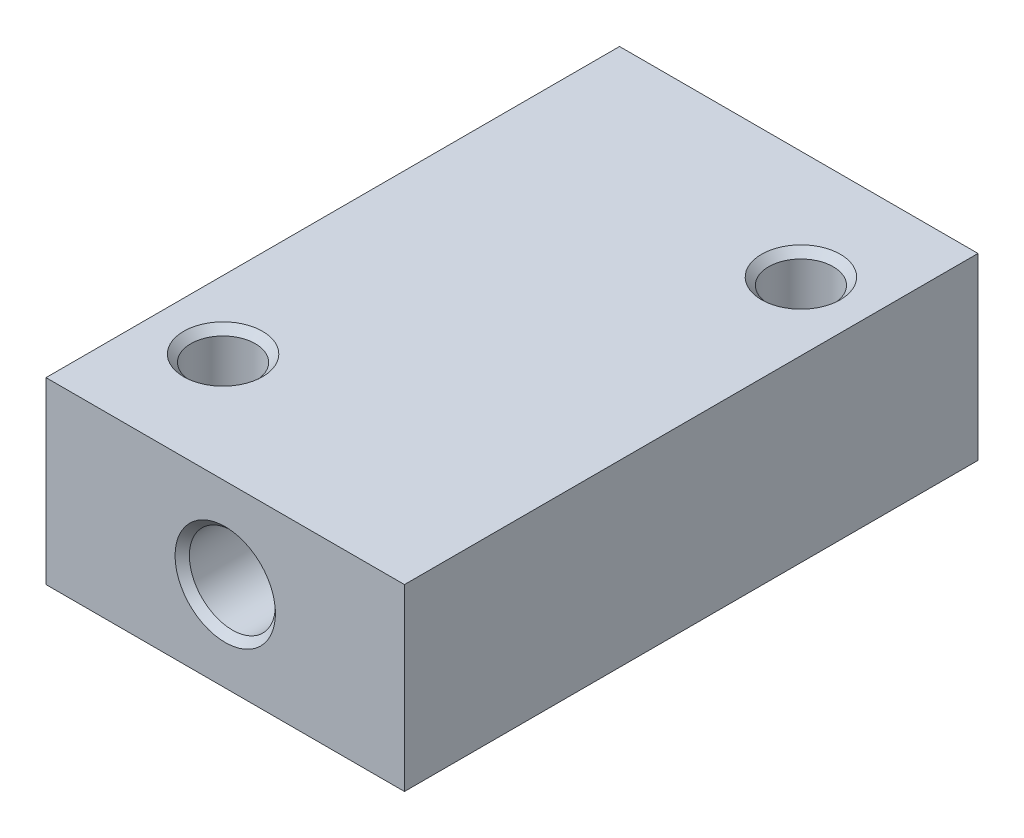
ISO-10303-21;
HEADER;
FILE_DESCRIPTION(('STEP AP214'),'2;1');
FILE_NAME('part.step','',(''),(''),'','','');
FILE_SCHEMA(('AUTOMOTIVE_DESIGN { 1 0 10303 214 1 1 1 1 }'));
ENDSEC;
DATA;
#1=APPLICATION_CONTEXT('core data for automotive mechanical design processes');
#2=APPLICATION_PROTOCOL_DEFINITION('international standard','automotive_design',2000,#1);
#3=PRODUCT_CONTEXT('',#1,'mechanical');
#4=PRODUCT('Part','Part','',(#3));
#5=PRODUCT_RELATED_PRODUCT_CATEGORY('part','',(#4));
#6=PRODUCT_DEFINITION_FORMATION('','',#4);
#7=PRODUCT_DEFINITION_CONTEXT('part definition',#1,'design');
#8=PRODUCT_DEFINITION('design','',#6,#7);
#9=PRODUCT_DEFINITION_SHAPE('','',#8);
#10=(LENGTH_UNIT() NAMED_UNIT(*) SI_UNIT(.MILLI.,.METRE.));
#11=(NAMED_UNIT(*) PLANE_ANGLE_UNIT() SI_UNIT($,.RADIAN.));
#12=(NAMED_UNIT(*) SI_UNIT($,.STERADIAN.) SOLID_ANGLE_UNIT());
#13=UNCERTAINTY_MEASURE_WITH_UNIT(LENGTH_MEASURE(1.E-05),#10,'distance_accuracy_value','');
#14=(GEOMETRIC_REPRESENTATION_CONTEXT(3) GLOBAL_UNCERTAINTY_ASSIGNED_CONTEXT((#13)) GLOBAL_UNIT_ASSIGNED_CONTEXT((#10,
#11,#12)) REPRESENTATION_CONTEXT('',''));
#15=CARTESIAN_POINT('',(0.,0.,0.));
#16=DIRECTION('',(0.,0.,1.));
#17=DIRECTION('',(1.,0.,0.));
#18=AXIS2_PLACEMENT_3D('',#15,#16,#17);
#19=CARTESIAN_POINT('',(0.,25.,0.));
#20=DIRECTION('',(0.,1.,0.));
#21=DIRECTION('',(0.,0.,1.));
#22=AXIS2_PLACEMENT_3D('',#19,#20,#21);
#23=PLANE('',#22);
#24=CARTESIAN_POINT('',(15.5000000000003,25.,-24.8000000000015));
#25=DIRECTION('',(0.,1.,0.));
#26=DIRECTION('',(0.,0.,1.));
#27=AXIS2_PLACEMENT_3D('',#24,#25,#26);
#28=CIRCLE('',#27,5.50000000000001);
#29=CARTESIAN_POINT('',(15.5000000000003,25.,-19.3000000000015));
#30=VERTEX_POINT('',#29);
#31=EDGE_CURVE('E11',#30,#30,#28,.F.);
#32=ORIENTED_EDGE('',*,*,#31,.T.);
#33=EDGE_LOOP('',(#32));
#34=FACE_BOUND('',#33,.T.);
#35=CARTESIAN_POINT('',(-15.5000000000013,25.,24.8000000000053));
#36=DIRECTION('',(0.,1.,0.));
#37=DIRECTION('',(0.,0.,1.));
#38=AXIS2_PLACEMENT_3D('',#35,#36,#37);
#39=CIRCLE('',#38,5.50000000000001);
#40=CARTESIAN_POINT('',(-15.5000000000013,25.,30.3000000000053));
#41=VERTEX_POINT('',#40);
#42=EDGE_CURVE('E45',#41,#41,#39,.F.);
#43=ORIENTED_EDGE('',*,*,#42,.T.);
#44=EDGE_LOOP('',(#43));
#45=FACE_BOUND('',#44,.T.);
#46=DIRECTION('',(0.,0.,-1.));
#47=VECTOR('',#46,1.);
#48=CARTESIAN_POINT('',(25.0000000000004,25.,-40.0000000000008));
#49=LINE('',#48,#47);
#50=CARTESIAN_POINT('',(25.0000000000024,25.,40.0000000000058));
#51=VERTEX_POINT('',#50);
#52=CARTESIAN_POINT('',(25.0000000000004,25.,-40.0000000000008));
#53=VERTEX_POINT('',#52);
#54=EDGE_CURVE('E88',#51,#53,#49,.T.);
#55=ORIENTED_EDGE('',*,*,#54,.T.);
#56=DIRECTION('',(-1.,0.,0.));
#57=VECTOR('',#56,1.);
#58=CARTESIAN_POINT('',(-25.0000000000014,25.,-40.0000000000026));
#59=LINE('',#58,#57);
#60=CARTESIAN_POINT('',(-25.0000000000014,25.,-40.0000000000026));
#61=VERTEX_POINT('',#60);
#62=EDGE_CURVE('E84',#53,#61,#59,.T.);
#63=ORIENTED_EDGE('',*,*,#62,.T.);
#64=DIRECTION('',(0.,0.,1.));
#65=VECTOR('',#64,1.);
#66=CARTESIAN_POINT('',(-25.0000000000014,25.,-40.0000000000026));
#67=LINE('',#66,#65);
#68=CARTESIAN_POINT('',(-25.0000000000037,25.,40.0000000000068));
#69=VERTEX_POINT('',#68);
#70=EDGE_CURVE('E86',#61,#69,#67,.T.);
#71=ORIENTED_EDGE('',*,*,#70,.T.);
#72=DIRECTION('',(1.,0.,0.));
#73=VECTOR('',#72,1.);
#74=CARTESIAN_POINT('',(-25.0000000000037,25.,40.0000000000068));
#75=LINE('',#74,#73);
#76=EDGE_CURVE('E53',#69,#51,#75,.T.);
#77=ORIENTED_EDGE('',*,*,#76,.T.);
#78=EDGE_LOOP('',(#55,#63,#71,#77));
#79=FACE_BOUND('',#78,.T.);
#80=ADVANCED_FACE('F36',(#34,#45,#79),#23,.T.);
#81=CARTESIAN_POINT('',(0.,0.,0.));
#82=DIRECTION('',(0.,1.,0.));
#83=DIRECTION('',(0.,0.,1.));
#84=AXIS2_PLACEMENT_3D('',#81,#82,#83);
#85=PLANE('',#84);
#86=CARTESIAN_POINT('',(15.5000000000003,0.,-24.8000000000015));
#87=DIRECTION('',(0.,1.,0.));
#88=DIRECTION('',(0.,0.,1.));
#89=AXIS2_PLACEMENT_3D('',#86,#87,#88);
#90=CIRCLE('',#89,5.50000000000002);
#91=CARTESIAN_POINT('',(15.5000000000003,0.,-19.3000000000015));
#92=VERTEX_POINT('',#91);
#93=EDGE_CURVE('E127',#92,#92,#90,.T.);
#94=ORIENTED_EDGE('',*,*,#93,.T.);
#95=EDGE_LOOP('',(#94));
#96=FACE_BOUND('',#95,.T.);
#97=CARTESIAN_POINT('',(-15.5000000000013,0.,24.8000000000053));
#98=DIRECTION('',(0.,1.,0.));
#99=DIRECTION('',(0.,0.,1.));
#100=AXIS2_PLACEMENT_3D('',#97,#98,#99);
#101=CIRCLE('',#100,5.50000000000002);
#102=CARTESIAN_POINT('',(-15.5000000000013,0.,30.3000000000053));
#103=VERTEX_POINT('',#102);
#104=EDGE_CURVE('E124',#103,#103,#101,.T.);
#105=ORIENTED_EDGE('',*,*,#104,.T.);
#106=EDGE_LOOP('',(#105));
#107=FACE_BOUND('',#106,.T.);
#108=DIRECTION('',(0.,0.,-1.));
#109=VECTOR('',#108,1.);
#110=CARTESIAN_POINT('',(25.0000000000004,0.,-40.0000000000008));
#111=LINE('',#110,#109);
#112=CARTESIAN_POINT('',(25.0000000000024,0.,40.0000000000058));
#113=VERTEX_POINT('',#112);
#114=CARTESIAN_POINT('',(25.0000000000004,0.,-40.0000000000008));
#115=VERTEX_POINT('',#114);
#116=EDGE_CURVE('E103',#113,#115,#111,.T.);
#117=ORIENTED_EDGE('',*,*,#116,.F.);
#118=DIRECTION('',(1.,0.,0.));
#119=VECTOR('',#118,1.);
#120=CARTESIAN_POINT('',(-25.0000000000037,0.,40.0000000000068));
#121=LINE('',#120,#119);
#122=CARTESIAN_POINT('',(-25.0000000000037,0.,40.0000000000068));
#123=VERTEX_POINT('',#122);
#124=EDGE_CURVE('E76',#123,#113,#121,.T.);
#125=ORIENTED_EDGE('',*,*,#124,.F.);
#126=DIRECTION('',(0.,0.,1.));
#127=VECTOR('',#126,1.);
#128=CARTESIAN_POINT('',(-25.0000000000014,0.,-40.0000000000026));
#129=LINE('',#128,#127);
#130=CARTESIAN_POINT('',(-25.0000000000014,0.,-40.0000000000026));
#131=VERTEX_POINT('',#130);
#132=EDGE_CURVE('E70',#131,#123,#129,.T.);
#133=ORIENTED_EDGE('',*,*,#132,.F.);
#134=DIRECTION('',(-1.,0.,0.));
#135=VECTOR('',#134,1.);
#136=CARTESIAN_POINT('',(-25.0000000000014,0.,-40.0000000000026));
#137=LINE('',#136,#135);
#138=EDGE_CURVE('E93',#115,#131,#137,.T.);
#139=ORIENTED_EDGE('',*,*,#138,.F.);
#140=EDGE_LOOP('',(#117,#125,#133,#139));
#141=FACE_BOUND('',#140,.T.);
#142=ADVANCED_FACE('F167',(#96,#107,#141),#85,.F.);
#143=CARTESIAN_POINT('',(25.0000000000004,25.,-40.0000000000008));
#144=DIRECTION('',(-1.,0.,0.));
#145=DIRECTION('',(0.,0.,1.));
#146=AXIS2_PLACEMENT_3D('',#143,#144,#145);
#147=PLANE('',#146);
#148=ORIENTED_EDGE('',*,*,#116,.T.);
#149=DIRECTION('',(0.,-1.,0.));
#150=VECTOR('',#149,1.);
#151=CARTESIAN_POINT('',(25.0000000000004,25.,-40.0000000000008));
#152=LINE('',#151,#150);
#153=EDGE_CURVE('E94',#53,#115,#152,.T.);
#154=ORIENTED_EDGE('',*,*,#153,.F.);
#155=ORIENTED_EDGE('',*,*,#54,.F.);
#156=DIRECTION('',(0.,-1.,0.));
#157=VECTOR('',#156,1.);
#158=CARTESIAN_POINT('',(25.0000000000024,25.,40.0000000000058));
#159=LINE('',#158,#157);
#160=EDGE_CURVE('E99',#51,#113,#159,.T.);
#161=ORIENTED_EDGE('',*,*,#160,.T.);
#162=EDGE_LOOP('',(#148,#154,#155,#161));
#163=FACE_BOUND('',#162,.T.);
#164=ADVANCED_FACE('F173',(#163),#147,.F.);
#165=CARTESIAN_POINT('',(-25.0000000000014,25.,-40.0000000000026));
#166=DIRECTION('',(0.,0.,1.));
#167=DIRECTION('',(1.,0.,0.));
#168=AXIS2_PLACEMENT_3D('',#165,#166,#167);
#169=PLANE('',#168);
#170=CARTESIAN_POINT('',(-7.21644966006352E-13,12.5000000000001,-40.0000000000029));
#171=DIRECTION('',(0.,0.,1.));
#172=DIRECTION('',(1.,0.,0.));
#173=AXIS2_PLACEMENT_3D('',#170,#171,#172);
#174=CIRCLE('',#173,7.00000000000002);
#175=CARTESIAN_POINT('',(6.99999999999931,12.5000000000001,-40.0000000000029));
#176=VERTEX_POINT('',#175);
#177=EDGE_CURVE('E112',#176,#176,#174,.T.);
#178=ORIENTED_EDGE('',*,*,#177,.T.);
#179=EDGE_LOOP('',(#178));
#180=FACE_BOUND('',#179,.T.);
#181=ORIENTED_EDGE('',*,*,#138,.T.);
#182=DIRECTION('',(0.,-1.,0.));
#183=VECTOR('',#182,1.);
#184=CARTESIAN_POINT('',(-25.0000000000014,25.,-40.0000000000026));
#185=LINE('',#184,#183);
#186=EDGE_CURVE('E91',#61,#131,#185,.T.);
#187=ORIENTED_EDGE('',*,*,#186,.F.);
#188=ORIENTED_EDGE('',*,*,#62,.F.);
#189=ORIENTED_EDGE('',*,*,#153,.T.);
#190=EDGE_LOOP('',(#181,#187,#188,#189));
#191=FACE_BOUND('',#190,.T.);
#192=ADVANCED_FACE('F92',(#180,#191),#169,.F.);
#193=CARTESIAN_POINT('',(-25.0000000000014,25.,-40.0000000000026));
#194=DIRECTION('',(1.,0.,0.));
#195=DIRECTION('',(0.,0.,-1.));
#196=AXIS2_PLACEMENT_3D('',#193,#194,#195);
#197=PLANE('',#196);
#198=ORIENTED_EDGE('',*,*,#132,.T.);
#199=DIRECTION('',(0.,-1.,0.));
#200=VECTOR('',#199,1.);
#201=CARTESIAN_POINT('',(-25.0000000000037,25.,40.0000000000068));
#202=LINE('',#201,#200);
#203=EDGE_CURVE('E95',#69,#123,#202,.T.);
#204=ORIENTED_EDGE('',*,*,#203,.F.);
#205=ORIENTED_EDGE('',*,*,#70,.F.);
#206=ORIENTED_EDGE('',*,*,#186,.T.);
#207=EDGE_LOOP('',(#198,#204,#205,#206));
#208=FACE_BOUND('',#207,.T.);
#209=ADVANCED_FACE('F97',(#208),#197,.F.);
#210=CARTESIAN_POINT('',(-25.0000000000037,25.,40.0000000000068));
#211=DIRECTION('',(0.,0.,-1.));
#212=DIRECTION('',(-1.,0.,0.));
#213=AXIS2_PLACEMENT_3D('',#210,#211,#212);
#214=PLANE('',#213);
#215=CARTESIAN_POINT('',(-9.43689570931383E-13,12.5000000000001,40.0000000000055));
#216=DIRECTION('',(0.,0.,-1.));
#217=DIRECTION('',(-1.,0.,0.));
#218=AXIS2_PLACEMENT_3D('',#215,#216,#217);
#219=CIRCLE('',#218,7.00000000000002);
#220=CARTESIAN_POINT('',(-7.00000000000097,12.5000000000001,40.0000000000055));
#221=VERTEX_POINT('',#220);
#222=EDGE_CURVE('E121',#221,#221,#219,.T.);
#223=ORIENTED_EDGE('',*,*,#222,.T.);
#224=EDGE_LOOP('',(#223));
#225=FACE_BOUND('',#224,.T.);
#226=ORIENTED_EDGE('',*,*,#124,.T.);
#227=ORIENTED_EDGE('',*,*,#160,.F.);
#228=ORIENTED_EDGE('',*,*,#76,.F.);
#229=ORIENTED_EDGE('',*,*,#203,.T.);
#230=EDGE_LOOP('',(#226,#227,#228,#229));
#231=FACE_BOUND('',#230,.T.);
#232=ADVANCED_FACE('F163',(#225,#231),#214,.F.);
#233=CARTESIAN_POINT('',(15.5000000000003,25.,-24.8000000000015));
#234=DIRECTION('',(0.,-1.,0.));
#235=DIRECTION('',(0.,0.,-1.));
#236=AXIS2_PLACEMENT_3D('',#233,#234,#235);
#237=CYLINDRICAL_SURFACE('',#236,4.5);
#238=CARTESIAN_POINT('',(15.5000000000003,0.99999999999989,-24.8000000000015));
#239=DIRECTION('',(0.,1.,0.));
#240=DIRECTION('',(0.,0.,1.));
#241=AXIS2_PLACEMENT_3D('',#238,#239,#240);
#242=CIRCLE('',#241,4.5);
#243=CARTESIAN_POINT('',(15.5000000000003,0.99999999999989,-20.3000000000015));
#244=VERTEX_POINT('',#243);
#245=EDGE_CURVE('E133',#244,#244,#242,.F.);
#246=ORIENTED_EDGE('',*,*,#245,.T.);
#247=EDGE_LOOP('',(#246));
#248=FACE_BOUND('',#247,.T.);
#249=CARTESIAN_POINT('',(15.5000000000003,24.,-24.8000000000015));
#250=DIRECTION('',(0.,1.,0.));
#251=DIRECTION('',(0.,0.,1.));
#252=AXIS2_PLACEMENT_3D('',#249,#250,#251);
#253=CIRCLE('',#252,4.5);
#254=CARTESIAN_POINT('',(15.5000000000003,24.,-20.3000000000015));
#255=VERTEX_POINT('',#254);
#256=EDGE_CURVE('E130',#255,#255,#253,.T.);
#257=ORIENTED_EDGE('',*,*,#256,.T.);
#258=EDGE_LOOP('',(#257));
#259=FACE_BOUND('',#258,.T.);
#260=ADVANCED_FACE('F153',(#248,#259),#237,.F.);
#261=CARTESIAN_POINT('',(-15.5000000000013,25.,24.8000000000053));
#262=DIRECTION('',(0.,-1.,0.));
#263=DIRECTION('',(0.,0.,-1.));
#264=AXIS2_PLACEMENT_3D('',#261,#262,#263);
#265=CYLINDRICAL_SURFACE('',#264,4.5);
#266=CARTESIAN_POINT('',(-15.5000000000013,0.99999999999989,24.8000000000053));
#267=DIRECTION('',(0.,1.,0.));
#268=DIRECTION('',(0.,0.,1.));
#269=AXIS2_PLACEMENT_3D('',#266,#267,#268);
#270=CIRCLE('',#269,4.5);
#271=CARTESIAN_POINT('',(-15.5000000000013,0.99999999999989,29.3000000000053));
#272=VERTEX_POINT('',#271);
#273=EDGE_CURVE('E139',#272,#272,#270,.F.);
#274=ORIENTED_EDGE('',*,*,#273,.T.);
#275=EDGE_LOOP('',(#274));
#276=FACE_BOUND('',#275,.T.);
#277=CARTESIAN_POINT('',(-15.5000000000013,24.,24.8000000000053));
#278=DIRECTION('',(0.,1.,0.));
#279=DIRECTION('',(0.,0.,1.));
#280=AXIS2_PLACEMENT_3D('',#277,#278,#279);
#281=CIRCLE('',#280,4.5);
#282=CARTESIAN_POINT('',(-15.5000000000013,24.,29.3000000000053));
#283=VERTEX_POINT('',#282);
#284=EDGE_CURVE('E136',#283,#283,#281,.T.);
#285=ORIENTED_EDGE('',*,*,#284,.T.);
#286=EDGE_LOOP('',(#285));
#287=FACE_BOUND('',#286,.T.);
#288=ADVANCED_FACE('F150',(#276,#287),#265,.F.);
#289=CARTESIAN_POINT('',(-7.21644966006352E-13,12.5000000000001,-40.0000000000029));
#290=DIRECTION('',(0.,0.,1.));
#291=DIRECTION('',(1.,0.,0.));
#292=AXIS2_PLACEMENT_3D('',#289,#290,#291);
#293=CYLINDRICAL_SURFACE('',#292,6.);
#294=CARTESIAN_POINT('',(1.66533453693773E-13,12.5000000000001,-39.0000000000018));
#295=DIRECTION('',(0.,0.,1.));
#296=DIRECTION('',(1.,0.,0.));
#297=AXIS2_PLACEMENT_3D('',#294,#295,#296);
#298=CIRCLE('',#297,6.);
#299=CARTESIAN_POINT('',(6.00000000000017,12.5000000000001,-39.0000000000018));
#300=VERTEX_POINT('',#299);
#301=EDGE_CURVE('E118',#300,#300,#298,.F.);
#302=ORIENTED_EDGE('',*,*,#301,.T.);
#303=EDGE_LOOP('',(#302));
#304=FACE_BOUND('',#303,.T.);
#305=CARTESIAN_POINT('',(-4.9960036108132E-13,12.5000000000001,39.0000000000052));
#306=DIRECTION('',(0.,0.,-1.));
#307=DIRECTION('',(-1.,0.,0.));
#308=AXIS2_PLACEMENT_3D('',#305,#306,#307);
#309=CIRCLE('',#308,6.);
#310=CARTESIAN_POINT('',(-6.00000000000051,12.5000000000001,39.0000000000052));
#311=VERTEX_POINT('',#310);
#312=EDGE_CURVE('E115',#311,#311,#309,.F.);
#313=ORIENTED_EDGE('',*,*,#312,.T.);
#314=EDGE_LOOP('',(#313));
#315=FACE_BOUND('',#314,.T.);
#316=ADVANCED_FACE('F152',(#304,#315),#293,.F.);
#317=CARTESIAN_POINT('',(-7.21644966006352E-13,12.5000000000001,-40.0000000000029));
#318=DIRECTION('',(0.,0.,-1.));
#319=DIRECTION('',(-1.,0.,0.));
#320=AXIS2_PLACEMENT_3D('',#317,#318,#319);
#321=CONICAL_SURFACE('',#320,7.00000000000002,0.78539816339745);
#322=ORIENTED_EDGE('',*,*,#301,.F.);
#323=EDGE_LOOP('',(#322));
#324=FACE_BOUND('',#323,.T.);
#325=ORIENTED_EDGE('',*,*,#177,.F.);
#326=EDGE_LOOP('',(#325));
#327=FACE_BOUND('',#326,.T.);
#328=ADVANCED_FACE('F160',(#324,#327),#321,.F.);
#329=CARTESIAN_POINT('',(-4.9960036108132E-13,12.5000000000001,39.0000000000052));
#330=DIRECTION('',(0.,0.,1.));
#331=DIRECTION('',(1.,0.,0.));
#332=AXIS2_PLACEMENT_3D('',#329,#330,#331);
#333=CONICAL_SURFACE('',#332,6.,0.785398163397458);
#334=ORIENTED_EDGE('',*,*,#222,.F.);
#335=EDGE_LOOP('',(#334));
#336=FACE_BOUND('',#335,.T.);
#337=ORIENTED_EDGE('',*,*,#312,.F.);
#338=EDGE_LOOP('',(#337));
#339=FACE_BOUND('',#338,.T.);
#340=ADVANCED_FACE('F190',(#336,#339),#333,.F.);
#341=CARTESIAN_POINT('',(15.5000000000003,0.,-24.8000000000015));
#342=DIRECTION('',(0.,-1.,0.));
#343=DIRECTION('',(0.,0.,-1.));
#344=AXIS2_PLACEMENT_3D('',#341,#342,#343);
#345=CONICAL_SURFACE('',#344,5.50000000000002,0.78539816339745);
#346=ORIENTED_EDGE('',*,*,#245,.F.);
#347=EDGE_LOOP('',(#346));
#348=FACE_BOUND('',#347,.T.);
#349=ORIENTED_EDGE('',*,*,#93,.F.);
#350=EDGE_LOOP('',(#349));
#351=FACE_BOUND('',#350,.T.);
#352=ADVANCED_FACE('F194',(#348,#351),#345,.F.);
#353=CARTESIAN_POINT('',(-15.5000000000013,0.,24.8000000000053));
#354=DIRECTION('',(0.,-1.,0.));
#355=DIRECTION('',(0.,0.,-1.));
#356=AXIS2_PLACEMENT_3D('',#353,#354,#355);
#357=CONICAL_SURFACE('',#356,5.50000000000002,0.78539816339745);
#358=ORIENTED_EDGE('',*,*,#273,.F.);
#359=EDGE_LOOP('',(#358));
#360=FACE_BOUND('',#359,.T.);
#361=ORIENTED_EDGE('',*,*,#104,.F.);
#362=EDGE_LOOP('',(#361));
#363=FACE_BOUND('',#362,.T.);
#364=ADVANCED_FACE('F198',(#360,#363),#357,.F.);
#365=CARTESIAN_POINT('',(15.5000000000003,24.,-24.8000000000015));
#366=DIRECTION('',(0.,1.,0.));
#367=DIRECTION('',(0.,0.,1.));
#368=AXIS2_PLACEMENT_3D('',#365,#366,#367);
#369=CONICAL_SURFACE('',#368,4.5,0.785398163397448);
#370=ORIENTED_EDGE('',*,*,#31,.F.);
#371=EDGE_LOOP('',(#370));
#372=FACE_BOUND('',#371,.T.);
#373=ORIENTED_EDGE('',*,*,#256,.F.);
#374=EDGE_LOOP('',(#373));
#375=FACE_BOUND('',#374,.T.);
#376=ADVANCED_FACE('F147',(#372,#375),#369,.F.);
#377=CARTESIAN_POINT('',(-15.5000000000013,24.,24.8000000000053));
#378=DIRECTION('',(0.,1.,0.));
#379=DIRECTION('',(0.,0.,1.));
#380=AXIS2_PLACEMENT_3D('',#377,#378,#379);
#381=CONICAL_SURFACE('',#380,4.5,0.785398163397448);
#382=ORIENTED_EDGE('',*,*,#42,.F.);
#383=EDGE_LOOP('',(#382));
#384=FACE_BOUND('',#383,.T.);
#385=ORIENTED_EDGE('',*,*,#284,.F.);
#386=EDGE_LOOP('',(#385));
#387=FACE_BOUND('',#386,.T.);
#388=ADVANCED_FACE('F38',(#384,#387),#381,.F.);
#389=CLOSED_SHELL('',(#80,#142,#164,#192,#209,#232,#260,#288,#316,#328,#340,#352,#364,#376,#388));
#390=MANIFOLD_SOLID_BREP('B2',#389);
#391=ADVANCED_BREP_SHAPE_REPRESENTATION('',(#18,#390),#14);
#392=SHAPE_DEFINITION_REPRESENTATION(#9,#391);
ENDSEC;
END-ISO-10303-21;
